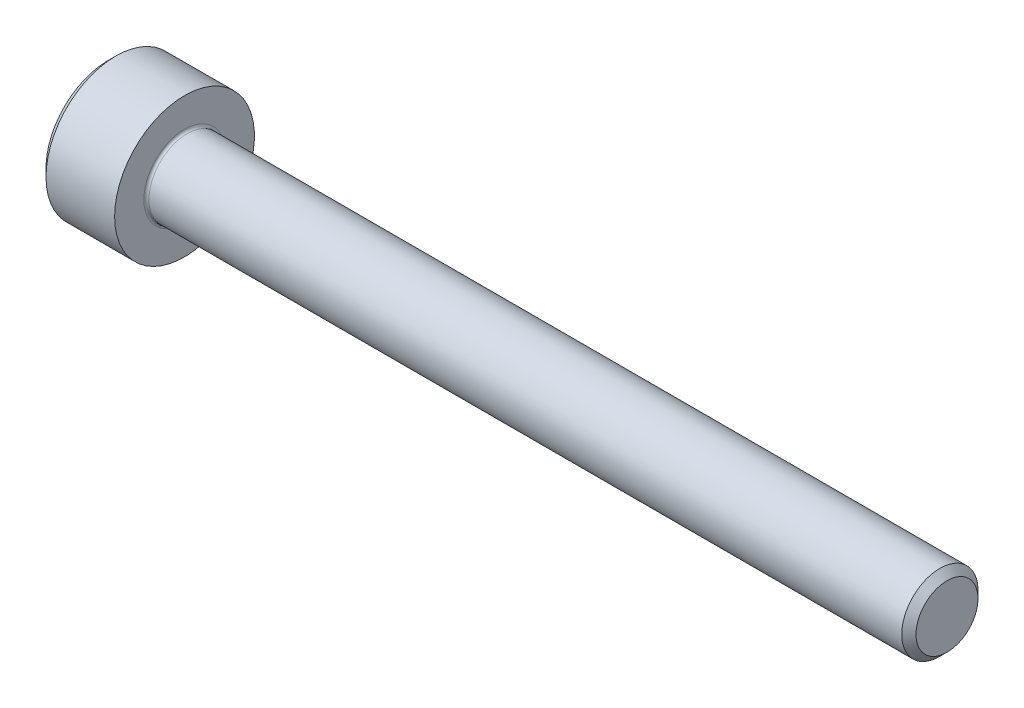
ISO-10303-21;
HEADER;
FILE_DESCRIPTION(('STEP AP214'),'2;1');
FILE_NAME('part.step','',(''),(''),'','','');
FILE_SCHEMA(('AUTOMOTIVE_DESIGN { 1 0 10303 214 1 1 1 1 }'));
ENDSEC;
DATA;
#1=APPLICATION_CONTEXT('core data for automotive mechanical design processes');
#2=APPLICATION_PROTOCOL_DEFINITION('international standard','automotive_design',2000,#1);
#3=PRODUCT_CONTEXT('',#1,'mechanical');
#4=PRODUCT('Part','Part','',(#3));
#5=PRODUCT_RELATED_PRODUCT_CATEGORY('part','',(#4));
#6=PRODUCT_DEFINITION_FORMATION('','',#4);
#7=PRODUCT_DEFINITION_CONTEXT('part definition',#1,'design');
#8=PRODUCT_DEFINITION('design','',#6,#7);
#9=PRODUCT_DEFINITION_SHAPE('','',#8);
#10=(LENGTH_UNIT() NAMED_UNIT(*) SI_UNIT(.MILLI.,.METRE.));
#11=(NAMED_UNIT(*) PLANE_ANGLE_UNIT() SI_UNIT($,.RADIAN.));
#12=(NAMED_UNIT(*) SI_UNIT($,.STERADIAN.) SOLID_ANGLE_UNIT());
#13=UNCERTAINTY_MEASURE_WITH_UNIT(LENGTH_MEASURE(1.E-05),#10,'distance_accuracy_value','');
#14=(GEOMETRIC_REPRESENTATION_CONTEXT(3) GLOBAL_UNCERTAINTY_ASSIGNED_CONTEXT((#13)) GLOBAL_UNIT_ASSIGNED_CONTEXT((#10,
#11,#12)) REPRESENTATION_CONTEXT('',''));
#15=CARTESIAN_POINT('',(0.,0.,0.));
#16=DIRECTION('',(0.,0.,1.));
#17=DIRECTION('',(1.,0.,0.));
#18=AXIS2_PLACEMENT_3D('',#15,#16,#17);
#19=CARTESIAN_POINT('',(1.30000000018526,0.,0.));
#20=DIRECTION('',(-1.,0.,0.));
#21=DIRECTION('',(0.,0.,1.));
#22=AXIS2_PLACEMENT_3D('',#19,#20,#21);
#23=CONICAL_SURFACE('',#22,1.27999999978101,1.04719755099051);
#24=CARTESIAN_POINT('',(1.30000000005399,0.,0.));
#25=DIRECTION('',(-1.,0.,0.));
#26=DIRECTION('',(0.,0.,1.));
#27=AXIS2_PLACEMENT_3D('',#24,#25,#26);
#28=CIRCLE('',#27,1.28000000000839);
#29=CARTESIAN_POINT('',(1.30000000002699,1.10851251684771,-0.640000000002097));
#30=VERTEX_POINT('',#29);
#31=CARTESIAN_POINT('',(1.30000000002699,0.,-1.28000000000419));
#32=VERTEX_POINT('',#31);
#33=EDGE_CURVE('E107',#30,#32,#28,.T.);
#34=ORIENTED_EDGE('',*,*,#33,.T.);
#35=CARTESIAN_POINT('',(1.30000000005399,0.,0.));
#36=DIRECTION('',(-1.,0.,0.));
#37=DIRECTION('',(0.,0.,1.));
#38=AXIS2_PLACEMENT_3D('',#35,#36,#37);
#39=CIRCLE('',#38,1.28000000000839);
#40=CARTESIAN_POINT('',(1.30000000002699,-1.10851251684772,-0.640000000002099));
#41=VERTEX_POINT('',#40);
#42=EDGE_CURVE('E108',#32,#41,#39,.T.);
#43=ORIENTED_EDGE('',*,*,#42,.T.);
#44=CARTESIAN_POINT('',(1.30000000005399,0.,0.));
#45=DIRECTION('',(-1.,0.,0.));
#46=DIRECTION('',(0.,0.,1.));
#47=AXIS2_PLACEMENT_3D('',#44,#45,#46);
#48=CIRCLE('',#47,1.28000000000839);
#49=CARTESIAN_POINT('',(1.30000000002699,-1.10851251684771,0.640000000002097));
#50=VERTEX_POINT('',#49);
#51=EDGE_CURVE('E217',#41,#50,#48,.T.);
#52=ORIENTED_EDGE('',*,*,#51,.T.);
#53=CARTESIAN_POINT('',(1.30000000005399,0.,0.));
#54=DIRECTION('',(-1.,0.,0.));
#55=DIRECTION('',(0.,0.,1.));
#56=AXIS2_PLACEMENT_3D('',#53,#54,#55);
#57=CIRCLE('',#56,1.28000000000839);
#58=CARTESIAN_POINT('',(1.30000000002699,0.,1.28000000000419));
#59=VERTEX_POINT('',#58);
#60=EDGE_CURVE('E89',#50,#59,#57,.T.);
#61=ORIENTED_EDGE('',*,*,#60,.T.);
#62=CARTESIAN_POINT('',(1.30000000005399,0.,0.));
#63=DIRECTION('',(-1.,0.,0.));
#64=DIRECTION('',(0.,0.,1.));
#65=AXIS2_PLACEMENT_3D('',#62,#63,#64);
#66=CIRCLE('',#65,1.28000000000839);
#67=CARTESIAN_POINT('',(1.30000000002699,1.10851251684771,0.640000000002096));
#68=VERTEX_POINT('',#67);
#69=EDGE_CURVE('E20',#59,#68,#66,.T.);
#70=ORIENTED_EDGE('',*,*,#69,.T.);
#71=CARTESIAN_POINT('',(1.30000000005399,0.,0.));
#72=DIRECTION('',(-1.,0.,0.));
#73=DIRECTION('',(0.,0.,1.));
#74=AXIS2_PLACEMENT_3D('',#71,#72,#73);
#75=CIRCLE('',#74,1.28000000000839);
#76=EDGE_CURVE('E94',#68,#30,#75,.T.);
#77=ORIENTED_EDGE('',*,*,#76,.T.);
#78=EDGE_LOOP('',(#34,#43,#52,#61,#70,#77));
#79=FACE_BOUND('',#78,.T.);
#80=CARTESIAN_POINT('',(2.03900834480919,0.,2.8421709430404E-10));
#81=VERTEX_POINT('',#80);
#82=VERTEX_LOOP('',#81);
#83=FACE_BOUND('',#82,.T.);
#84=ADVANCED_FACE('F17',(#79,#83),#23,.F.);
#85=CARTESIAN_POINT('',(1.3,1.47801668912544,0.));
#86=DIRECTION('',(1.,0.,0.));
#87=DIRECTION('',(0.,0.,-1.));
#88=AXIS2_PLACEMENT_3D('',#85,#86,#87);
#89=PLANE('',#88);
#90=DIRECTION('',(0.,0.5,-0.866025403784439));
#91=VECTOR('',#90,1.);
#92=CARTESIAN_POINT('',(1.3,1.47801668912544,0.));
#93=LINE('',#92,#91);
#94=CARTESIAN_POINT('',(1.3,0.739008344562718,1.28));
#95=VERTEX_POINT('',#94);
#96=EDGE_CURVE('E111',#68,#95,#93,.F.);
#97=ORIENTED_EDGE('',*,*,#96,.F.);
#98=ORIENTED_EDGE('',*,*,#69,.F.);
#99=DIRECTION('',(0.,-1.,0.));
#100=VECTOR('',#99,1.);
#101=CARTESIAN_POINT('',(1.3,-0.739008344562723,1.28));
#102=LINE('',#101,#100);
#103=EDGE_CURVE('E113',#59,#95,#102,.F.);
#104=ORIENTED_EDGE('',*,*,#103,.T.);
#105=EDGE_LOOP('',(#97,#98,#104));
#106=FACE_BOUND('',#105,.T.);
#107=ADVANCED_FACE('F112',(#106),#89,.F.);
#108=CARTESIAN_POINT('',(1.3,1.47801668912544,0.));
#109=DIRECTION('',(1.,0.,0.));
#110=DIRECTION('',(0.,0.,-1.));
#111=AXIS2_PLACEMENT_3D('',#108,#109,#110);
#112=PLANE('',#111);
#113=DIRECTION('',(0.,-1.,0.));
#114=VECTOR('',#113,1.);
#115=CARTESIAN_POINT('',(1.3,-0.739008344562723,1.28));
#116=LINE('',#115,#114);
#117=CARTESIAN_POINT('',(1.3,-0.739008344562723,1.28));
#118=VERTEX_POINT('',#117);
#119=EDGE_CURVE('E116',#118,#59,#116,.F.);
#120=ORIENTED_EDGE('',*,*,#119,.T.);
#121=ORIENTED_EDGE('',*,*,#60,.F.);
#122=DIRECTION('',(0.,0.5,0.866025403784438));
#123=VECTOR('',#122,1.);
#124=CARTESIAN_POINT('',(1.3,-0.739008344562723,1.28));
#125=LINE('',#124,#123);
#126=EDGE_CURVE('E168',#118,#50,#125,.F.);
#127=ORIENTED_EDGE('',*,*,#126,.F.);
#128=EDGE_LOOP('',(#120,#121,#127));
#129=FACE_BOUND('',#128,.T.);
#130=ADVANCED_FACE('F226',(#129),#112,.F.);
#131=CARTESIAN_POINT('',(1.3,1.47801668912544,0.));
#132=DIRECTION('',(1.,0.,0.));
#133=DIRECTION('',(0.,0.,-1.));
#134=AXIS2_PLACEMENT_3D('',#131,#132,#133);
#135=PLANE('',#134);
#136=DIRECTION('',(0.,0.5,0.866025403784438));
#137=VECTOR('',#136,1.);
#138=CARTESIAN_POINT('',(1.3,-0.739008344562723,1.28));
#139=LINE('',#138,#137);
#140=CARTESIAN_POINT('',(1.3,-1.47801668912545,0.));
#141=VERTEX_POINT('',#140);
#142=EDGE_CURVE('E164',#50,#141,#139,.F.);
#143=ORIENTED_EDGE('',*,*,#142,.F.);
#144=ORIENTED_EDGE('',*,*,#51,.F.);
#145=DIRECTION('',(0.,-0.5,0.866025403784439));
#146=VECTOR('',#145,1.);
#147=CARTESIAN_POINT('',(1.3,-1.47801668912545,0.));
#148=LINE('',#147,#146);
#149=EDGE_CURVE('E151',#141,#41,#148,.F.);
#150=ORIENTED_EDGE('',*,*,#149,.F.);
#151=EDGE_LOOP('',(#143,#144,#150));
#152=FACE_BOUND('',#151,.T.);
#153=ADVANCED_FACE('F227',(#152),#135,.F.);
#154=CARTESIAN_POINT('',(1.3,1.47801668912544,0.));
#155=DIRECTION('',(1.,0.,0.));
#156=DIRECTION('',(0.,0.,-1.));
#157=AXIS2_PLACEMENT_3D('',#154,#155,#156);
#158=PLANE('',#157);
#159=DIRECTION('',(0.,-0.5,0.866025403784439));
#160=VECTOR('',#159,1.);
#161=CARTESIAN_POINT('',(1.3,-1.47801668912545,0.));
#162=LINE('',#161,#160);
#163=CARTESIAN_POINT('',(1.3,-0.739008344562727,-1.28));
#164=VERTEX_POINT('',#163);
#165=EDGE_CURVE('E148',#41,#164,#162,.F.);
#166=ORIENTED_EDGE('',*,*,#165,.F.);
#167=ORIENTED_EDGE('',*,*,#42,.F.);
#168=DIRECTION('',(0.,1.,0.));
#169=VECTOR('',#168,1.);
#170=CARTESIAN_POINT('',(1.3,0.739008344562717,-1.28));
#171=LINE('',#170,#169);
#172=EDGE_CURVE('E142',#32,#164,#171,.F.);
#173=ORIENTED_EDGE('',*,*,#172,.T.);
#174=EDGE_LOOP('',(#166,#167,#173));
#175=FACE_BOUND('',#174,.T.);
#176=ADVANCED_FACE('F265',(#175),#158,.F.);
#177=CARTESIAN_POINT('',(1.3,1.47801668912544,0.));
#178=DIRECTION('',(1.,0.,0.));
#179=DIRECTION('',(0.,0.,-1.));
#180=AXIS2_PLACEMENT_3D('',#177,#178,#179);
#181=PLANE('',#180);
#182=DIRECTION('',(0.,0.5,0.866025403784438));
#183=VECTOR('',#182,1.);
#184=CARTESIAN_POINT('',(1.3,1.47801668912544,0.));
#185=LINE('',#184,#183);
#186=CARTESIAN_POINT('',(1.3,1.47801668912544,0.));
#187=VERTEX_POINT('',#186);
#188=EDGE_CURVE('E105',#187,#30,#185,.F.);
#189=ORIENTED_EDGE('',*,*,#188,.T.);
#190=ORIENTED_EDGE('',*,*,#76,.F.);
#191=DIRECTION('',(0.,0.5,-0.866025403784439));
#192=VECTOR('',#191,1.);
#193=CARTESIAN_POINT('',(1.3,1.47801668912544,0.));
#194=LINE('',#193,#192);
#195=EDGE_CURVE('E102',#187,#68,#194,.F.);
#196=ORIENTED_EDGE('',*,*,#195,.F.);
#197=EDGE_LOOP('',(#189,#190,#196));
#198=FACE_BOUND('',#197,.T.);
#199=ADVANCED_FACE('F100',(#198),#181,.F.);
#200=CARTESIAN_POINT('',(1.3,1.47801668912544,0.));
#201=DIRECTION('',(1.,0.,0.));
#202=DIRECTION('',(0.,0.,-1.));
#203=AXIS2_PLACEMENT_3D('',#200,#201,#202);
#204=PLANE('',#203);
#205=DIRECTION('',(0.,1.,0.));
#206=VECTOR('',#205,1.);
#207=CARTESIAN_POINT('',(1.3,0.739008344562717,-1.28));
#208=LINE('',#207,#206);
#209=CARTESIAN_POINT('',(1.3,0.739008344562719,-1.28));
#210=VERTEX_POINT('',#209);
#211=EDGE_CURVE('E145',#210,#32,#208,.F.);
#212=ORIENTED_EDGE('',*,*,#211,.T.);
#213=ORIENTED_EDGE('',*,*,#33,.F.);
#214=DIRECTION('',(0.,0.5,0.866025403784438));
#215=VECTOR('',#214,1.);
#216=CARTESIAN_POINT('',(1.3,1.47801668912544,0.));
#217=LINE('',#216,#215);
#218=EDGE_CURVE('E249',#30,#210,#217,.F.);
#219=ORIENTED_EDGE('',*,*,#218,.T.);
#220=EDGE_LOOP('',(#212,#213,#219));
#221=FACE_BOUND('',#220,.T.);
#222=ADVANCED_FACE('F262',(#221),#204,.F.);
#223=CARTESIAN_POINT('',(1.3,1.47801668912544,0.));
#224=DIRECTION('',(0.,-0.866025403784439,-0.5));
#225=DIRECTION('',(0.,0.5,-0.866025403784439));
#226=AXIS2_PLACEMENT_3D('',#223,#224,#225);
#227=PLANE('',#226);
#228=ORIENTED_EDGE('',*,*,#96,.T.);
#229=DIRECTION('',(1.,0.,0.));
#230=VECTOR('',#229,1.);
#231=CARTESIAN_POINT('',(1.3,0.739008344562719,1.28));
#232=LINE('',#231,#230);
#233=CARTESIAN_POINT('',(0.,0.739008344562718,1.28));
#234=VERTEX_POINT('',#233);
#235=EDGE_CURVE('E188',#95,#234,#232,.F.);
#236=ORIENTED_EDGE('',*,*,#235,.T.);
#237=DIRECTION('',(0.,-0.499999999999999,0.866025403784439));
#238=VECTOR('',#237,1.);
#239=CARTESIAN_POINT('',(0.,1.47801668912544,0.));
#240=LINE('',#239,#238);
#241=CARTESIAN_POINT('',(0.,1.47801668912544,0.));
#242=VERTEX_POINT('',#241);
#243=EDGE_CURVE('E129',#242,#234,#240,.T.);
#244=ORIENTED_EDGE('',*,*,#243,.F.);
#245=DIRECTION('',(1.,0.,0.));
#246=VECTOR('',#245,1.);
#247=CARTESIAN_POINT('',(1.3,1.47801668912544,0.));
#248=LINE('',#247,#246);
#249=EDGE_CURVE('E120',#242,#187,#248,.T.);
#250=ORIENTED_EDGE('',*,*,#249,.T.);
#251=ORIENTED_EDGE('',*,*,#195,.T.);
#252=EDGE_LOOP('',(#228,#236,#244,#250,#251));
#253=FACE_BOUND('',#252,.T.);
#254=ADVANCED_FACE('F118',(#253),#227,.T.);
#255=CARTESIAN_POINT('',(1.3,-0.739008344562723,1.28));
#256=DIRECTION('',(0.,0.,1.));
#257=DIRECTION('',(0.,-1.,0.));
#258=AXIS2_PLACEMENT_3D('',#255,#256,#257);
#259=PLANE('',#258);
#260=ORIENTED_EDGE('',*,*,#235,.F.);
#261=ORIENTED_EDGE('',*,*,#103,.F.);
#262=ORIENTED_EDGE('',*,*,#119,.F.);
#263=DIRECTION('',(1.,0.,0.));
#264=VECTOR('',#263,1.);
#265=CARTESIAN_POINT('',(1.3,-0.739008344562723,1.28));
#266=LINE('',#265,#264);
#267=CARTESIAN_POINT('',(0.,-0.739008344562723,1.28));
#268=VERTEX_POINT('',#267);
#269=EDGE_CURVE('E183',#268,#118,#266,.T.);
#270=ORIENTED_EDGE('',*,*,#269,.F.);
#271=DIRECTION('',(0.,1.,0.));
#272=VECTOR('',#271,1.);
#273=CARTESIAN_POINT('',(0.,0.,1.28));
#274=LINE('',#273,#272);
#275=EDGE_CURVE('E132',#234,#268,#274,.F.);
#276=ORIENTED_EDGE('',*,*,#275,.F.);
#277=EDGE_LOOP('',(#260,#261,#262,#270,#276));
#278=FACE_BOUND('',#277,.T.);
#279=ADVANCED_FACE('F233',(#278),#259,.F.);
#280=CARTESIAN_POINT('',(1.3,-0.739008344562723,1.28));
#281=DIRECTION('',(0.,0.866025403784438,-0.5));
#282=DIRECTION('',(0.,0.5,0.866025403784438));
#283=AXIS2_PLACEMENT_3D('',#280,#281,#282);
#284=PLANE('',#283);
#285=ORIENTED_EDGE('',*,*,#142,.T.);
#286=DIRECTION('',(1.,0.,0.));
#287=VECTOR('',#286,1.);
#288=CARTESIAN_POINT('',(1.3,-1.47801668912545,0.));
#289=LINE('',#288,#287);
#290=CARTESIAN_POINT('',(0.,-1.47801668912545,0.));
#291=VERTEX_POINT('',#290);
#292=EDGE_CURVE('E159',#291,#141,#289,.T.);
#293=ORIENTED_EDGE('',*,*,#292,.F.);
#294=DIRECTION('',(0.,-0.500000000000003,-0.866025403784437));
#295=VECTOR('',#294,1.);
#296=CARTESIAN_POINT('',(0.,-0.739008344562723,1.28));
#297=LINE('',#296,#295);
#298=EDGE_CURVE('E174',#268,#291,#297,.T.);
#299=ORIENTED_EDGE('',*,*,#298,.F.);
#300=ORIENTED_EDGE('',*,*,#269,.T.);
#301=ORIENTED_EDGE('',*,*,#126,.T.);
#302=EDGE_LOOP('',(#285,#293,#299,#300,#301));
#303=FACE_BOUND('',#302,.T.);
#304=ADVANCED_FACE('F229',(#303),#284,.T.);
#305=CARTESIAN_POINT('',(1.3,-1.47801668912545,0.));
#306=DIRECTION('',(0.,0.866025403784439,0.5));
#307=DIRECTION('',(0.,-0.5,0.866025403784439));
#308=AXIS2_PLACEMENT_3D('',#305,#306,#307);
#309=PLANE('',#308);
#310=ORIENTED_EDGE('',*,*,#165,.T.);
#311=DIRECTION('',(1.,0.,0.));
#312=VECTOR('',#311,1.);
#313=CARTESIAN_POINT('',(1.3,-0.739008344562725,-1.28));
#314=LINE('',#313,#312);
#315=CARTESIAN_POINT('',(0.,-0.739008344562727,-1.28));
#316=VERTEX_POINT('',#315);
#317=EDGE_CURVE('E144',#164,#316,#314,.F.);
#318=ORIENTED_EDGE('',*,*,#317,.T.);
#319=DIRECTION('',(0.,0.500000000000002,-0.866025403784437));
#320=VECTOR('',#319,1.);
#321=CARTESIAN_POINT('',(0.,-1.47801668912545,0.));
#322=LINE('',#321,#320);
#323=EDGE_CURVE('E171',#291,#316,#322,.T.);
#324=ORIENTED_EDGE('',*,*,#323,.F.);
#325=ORIENTED_EDGE('',*,*,#292,.T.);
#326=ORIENTED_EDGE('',*,*,#149,.T.);
#327=EDGE_LOOP('',(#310,#318,#324,#325,#326));
#328=FACE_BOUND('',#327,.T.);
#329=ADVANCED_FACE('F268',(#328),#309,.T.);
#330=CARTESIAN_POINT('',(1.3,0.739008344562717,-1.28));
#331=DIRECTION('',(0.,0.,-1.));
#332=DIRECTION('',(0.,1.,0.));
#333=AXIS2_PLACEMENT_3D('',#330,#331,#332);
#334=PLANE('',#333);
#335=ORIENTED_EDGE('',*,*,#317,.F.);
#336=ORIENTED_EDGE('',*,*,#172,.F.);
#337=ORIENTED_EDGE('',*,*,#211,.F.);
#338=DIRECTION('',(1.,0.,0.));
#339=VECTOR('',#338,1.);
#340=CARTESIAN_POINT('',(1.3,0.73900834456272,-1.28));
#341=LINE('',#340,#339);
#342=CARTESIAN_POINT('',(0.,0.739008344562718,-1.28));
#343=VERTEX_POINT('',#342);
#344=EDGE_CURVE('E35',#210,#343,#341,.F.);
#345=ORIENTED_EDGE('',*,*,#344,.T.);
#346=DIRECTION('',(0.,1.,0.));
#347=VECTOR('',#346,1.);
#348=CARTESIAN_POINT('',(0.,0.,-1.28));
#349=LINE('',#348,#347);
#350=EDGE_CURVE('E139',#316,#343,#349,.T.);
#351=ORIENTED_EDGE('',*,*,#350,.F.);
#352=EDGE_LOOP('',(#335,#336,#337,#345,#351));
#353=FACE_BOUND('',#352,.T.);
#354=ADVANCED_FACE('F266',(#353),#334,.F.);
#355=CARTESIAN_POINT('',(1.3,1.47801668912544,0.));
#356=DIRECTION('',(0.,0.866025403784438,-0.5));
#357=DIRECTION('',(0.,0.5,0.866025403784438));
#358=AXIS2_PLACEMENT_3D('',#355,#356,#357);
#359=PLANE('',#358);
#360=ORIENTED_EDGE('',*,*,#344,.F.);
#361=ORIENTED_EDGE('',*,*,#218,.F.);
#362=ORIENTED_EDGE('',*,*,#188,.F.);
#363=ORIENTED_EDGE('',*,*,#249,.F.);
#364=DIRECTION('',(0.,0.500000000000002,0.866025403784437));
#365=VECTOR('',#364,1.);
#366=CARTESIAN_POINT('',(0.,0.739008344562717,-1.28));
#367=LINE('',#366,#365);
#368=EDGE_CURVE('E135',#343,#242,#367,.T.);
#369=ORIENTED_EDGE('',*,*,#368,.F.);
#370=EDGE_LOOP('',(#360,#361,#362,#363,#369));
#371=FACE_BOUND('',#370,.T.);
#372=ADVANCED_FACE('F236',(#371),#359,.F.);
#373=CARTESIAN_POINT('',(0.,0.,0.));
#374=DIRECTION('',(-1.,0.,0.));
#375=DIRECTION('',(0.,0.,1.));
#376=AXIS2_PLACEMENT_3D('',#373,#374,#375);
#377=PLANE('',#376);
#378=ORIENTED_EDGE('',*,*,#350,.T.);
#379=ORIENTED_EDGE('',*,*,#368,.T.);
#380=ORIENTED_EDGE('',*,*,#243,.T.);
#381=ORIENTED_EDGE('',*,*,#275,.T.);
#382=ORIENTED_EDGE('',*,*,#298,.T.);
#383=ORIENTED_EDGE('',*,*,#323,.T.);
#384=EDGE_LOOP('',(#378,#379,#380,#381,#382,#383));
#385=FACE_BOUND('',#384,.T.);
#386=CARTESIAN_POINT('',(0.,0.,0.));
#387=DIRECTION('',(1.,0.,0.));
#388=DIRECTION('',(0.,0.,-1.));
#389=AXIS2_PLACEMENT_3D('',#386,#387,#388);
#390=CIRCLE('',#389,2.45000000001028);
#391=CARTESIAN_POINT('',(0.,0.,-2.45000000001028));
#392=VERTEX_POINT('',#391);
#393=EDGE_CURVE('E138',#392,#392,#390,.T.);
#394=ORIENTED_EDGE('',*,*,#393,.F.);
#395=EDGE_LOOP('',(#394));
#396=FACE_BOUND('',#395,.T.);
#397=ADVANCED_FACE('F239',(#385,#396),#377,.T.);
#398=CARTESIAN_POINT('',(0.299999999981537,0.,0.));
#399=DIRECTION('',(1.,0.,0.));
#400=DIRECTION('',(0.,0.,-1.));
#401=AXIS2_PLACEMENT_3D('',#398,#399,#400);
#402=CONICAL_SURFACE('',#401,2.74999999999181,0.785398163397448);
#403=ORIENTED_EDGE('',*,*,#393,.T.);
#404=EDGE_LOOP('',(#403));
#405=FACE_BOUND('',#404,.T.);
#406=CARTESIAN_POINT('',(0.300000000000002,0.,0.));
#407=DIRECTION('',(-1.,0.,0.));
#408=DIRECTION('',(0.,0.,1.));
#409=AXIS2_PLACEMENT_3D('',#406,#407,#408);
#410=CIRCLE('',#409,2.75);
#411=CARTESIAN_POINT('',(0.300000000000002,0.,2.75));
#412=VERTEX_POINT('',#411);
#413=EDGE_CURVE('E213',#412,#412,#410,.F.);
#414=ORIENTED_EDGE('',*,*,#413,.F.);
#415=EDGE_LOOP('',(#414));
#416=FACE_BOUND('',#415,.T.);
#417=ADVANCED_FACE('F321',(#405,#416),#402,.T.);
#418=CARTESIAN_POINT('',(-31.75,0.,0.));
#419=DIRECTION('',(-1.,0.,0.));
#420=DIRECTION('',(0.,0.,1.));
#421=AXIS2_PLACEMENT_3D('',#418,#419,#420);
#422=CYLINDRICAL_SURFACE('',#421,2.75);
#423=CARTESIAN_POINT('',(3.,0.,0.));
#424=DIRECTION('',(-1.,0.,0.));
#425=DIRECTION('',(0.,0.,1.));
#426=AXIS2_PLACEMENT_3D('',#423,#424,#425);
#427=CIRCLE('',#426,2.75);
#428=CARTESIAN_POINT('',(3.,0.,2.75));
#429=VERTEX_POINT('',#428);
#430=EDGE_CURVE('E210',#429,#429,#427,.F.);
#431=ORIENTED_EDGE('',*,*,#430,.F.);
#432=EDGE_LOOP('',(#431));
#433=FACE_BOUND('',#432,.T.);
#434=ORIENTED_EDGE('',*,*,#413,.T.);
#435=EDGE_LOOP('',(#434));
#436=FACE_BOUND('',#435,.T.);
#437=ADVANCED_FACE('F318',(#433,#436),#422,.T.);
#438=CARTESIAN_POINT('',(3.,2.75,0.));
#439=DIRECTION('',(1.,0.,0.));
#440=DIRECTION('',(0.,0.,-1.));
#441=AXIS2_PLACEMENT_3D('',#438,#439,#440);
#442=PLANE('',#441);
#443=CARTESIAN_POINT('',(3.,0.,0.));
#444=DIRECTION('',(1.,0.,0.));
#445=DIRECTION('',(0.,0.,1.));
#446=AXIS2_PLACEMENT_3D('',#443,#444,#445);
#447=CIRCLE('',#446,1.6);
#448=CARTESIAN_POINT('',(3.,0.,1.6));
#449=VERTEX_POINT('',#448);
#450=EDGE_CURVE('E209',#449,#449,#447,.F.);
#451=ORIENTED_EDGE('',*,*,#450,.T.);
#452=EDGE_LOOP('',(#451));
#453=FACE_BOUND('',#452,.T.);
#454=ORIENTED_EDGE('',*,*,#430,.T.);
#455=EDGE_LOOP('',(#454));
#456=FACE_BOUND('',#455,.T.);
#457=ADVANCED_FACE('F309',(#453,#456),#442,.T.);
#458=CARTESIAN_POINT('',(33.,1.2195,0.));
#459=DIRECTION('',(1.,0.,0.));
#460=DIRECTION('',(0.,0.,-1.));
#461=AXIS2_PLACEMENT_3D('',#458,#459,#460);
#462=PLANE('',#461);
#463=CARTESIAN_POINT('',(33.0000000000155,0.,0.));
#464=DIRECTION('',(-1.,0.,0.));
#465=DIRECTION('',(0.,0.,1.));
#466=AXIS2_PLACEMENT_3D('',#463,#464,#465);
#467=CIRCLE('',#466,1.21950000004745);
#468=CARTESIAN_POINT('',(33.0000000000155,0.,1.21950000004745));
#469=VERTEX_POINT('',#468);
#470=EDGE_CURVE('E206',#469,#469,#467,.T.);
#471=ORIENTED_EDGE('',*,*,#470,.F.);
#472=EDGE_LOOP('',(#471));
#473=FACE_BOUND('',#472,.T.);
#474=ADVANCED_FACE('F295',(#473),#462,.T.);
#475=CARTESIAN_POINT('',(3.1,0.,0.));
#476=DIRECTION('',(1.,0.,0.));
#477=DIRECTION('',(0.,0.,-1.));
#478=AXIS2_PLACEMENT_3D('',#475,#476,#477);
#479=TOROIDAL_SURFACE('',#478,1.6,0.1);
#480=ORIENTED_EDGE('',*,*,#450,.F.);
#481=EDGE_LOOP('',(#480));
#482=FACE_BOUND('',#481,.T.);
#483=CARTESIAN_POINT('',(3.1,0.,0.));
#484=DIRECTION('',(-1.,0.,0.));
#485=DIRECTION('',(0.,0.,1.));
#486=AXIS2_PLACEMENT_3D('',#483,#484,#485);
#487=CIRCLE('',#486,1.49999999999999);
#488=CARTESIAN_POINT('',(3.1,0.,1.49999999999999));
#489=VERTEX_POINT('',#488);
#490=EDGE_CURVE('E26',#489,#489,#487,.F.);
#491=ORIENTED_EDGE('',*,*,#490,.F.);
#492=EDGE_LOOP('',(#491));
#493=FACE_BOUND('',#492,.T.);
#494=ADVANCED_FACE('F286',(#482,#493),#479,.F.);
#495=CARTESIAN_POINT('',(32.7194999999847,0.,0.));
#496=DIRECTION('',(-1.,0.,0.));
#497=DIRECTION('',(0.,0.,1.));
#498=AXIS2_PLACEMENT_3D('',#495,#496,#497);
#499=CONICAL_SURFACE('',#498,1.50000000002137,0.785398163296123);
#500=ORIENTED_EDGE('',*,*,#470,.T.);
#501=EDGE_LOOP('',(#500));
#502=FACE_BOUND('',#501,.T.);
#503=CARTESIAN_POINT('',(32.7195,0.,0.));
#504=DIRECTION('',(-1.,0.,0.));
#505=DIRECTION('',(0.,0.,1.));
#506=AXIS2_PLACEMENT_3D('',#503,#504,#505);
#507=CIRCLE('',#506,1.49999999999999);
#508=CARTESIAN_POINT('',(32.7195,0.,1.49999999999999));
#509=VERTEX_POINT('',#508);
#510=EDGE_CURVE('E11',#509,#509,#507,.T.);
#511=ORIENTED_EDGE('',*,*,#510,.F.);
#512=EDGE_LOOP('',(#511));
#513=FACE_BOUND('',#512,.T.);
#514=ADVANCED_FACE('F280',(#502,#513),#499,.T.);
#515=CARTESIAN_POINT('',(-31.75,0.,0.));
#516=DIRECTION('',(-1.,0.,0.));
#517=DIRECTION('',(0.,0.,1.));
#518=AXIS2_PLACEMENT_3D('',#515,#516,#517);
#519=CYLINDRICAL_SURFACE('',#518,1.49999999999999);
#520=ORIENTED_EDGE('',*,*,#510,.T.);
#521=EDGE_LOOP('',(#520));
#522=FACE_BOUND('',#521,.T.);
#523=ORIENTED_EDGE('',*,*,#490,.T.);
#524=EDGE_LOOP('',(#523));
#525=FACE_BOUND('',#524,.T.);
#526=ADVANCED_FACE('F278',(#522,#525),#519,.T.);
#527=CLOSED_SHELL('',(#84,#107,#130,#153,#176,#199,#222,#254,#279,#304,#329,#354,#372,#397,#417,
#437,#457,#474,#494,#514,#526));
#528=MANIFOLD_SOLID_BREP('B1',#527);
#529=ADVANCED_BREP_SHAPE_REPRESENTATION('',(#18,#528),#14);
#530=SHAPE_DEFINITION_REPRESENTATION(#9,#529);
ENDSEC;
END-ISO-10303-21;
